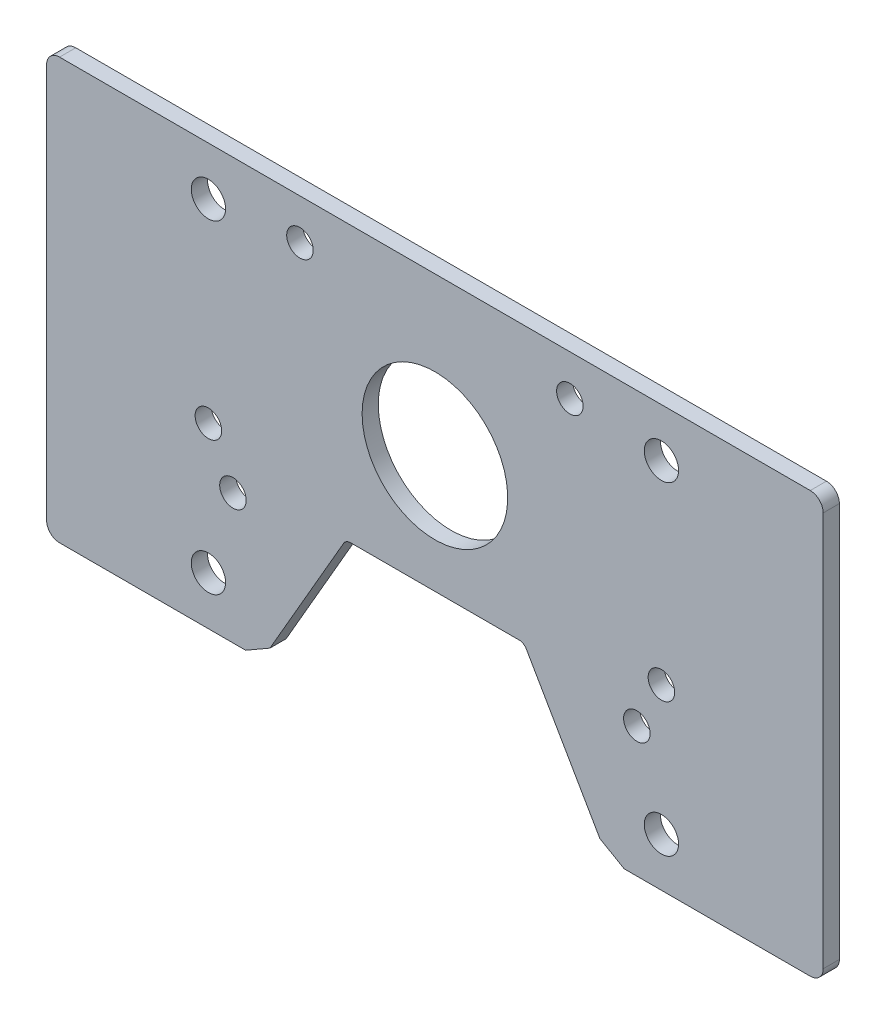
ISO-10303-21;
HEADER;
FILE_DESCRIPTION(('STEP AP214'),'2;1');
FILE_NAME('part.step','',(''),(''),'','','');
FILE_SCHEMA(('AUTOMOTIVE_DESIGN { 1 0 10303 214 1 1 1 1 }'));
ENDSEC;
DATA;
#1=APPLICATION_CONTEXT('core data for automotive mechanical design processes');
#2=APPLICATION_PROTOCOL_DEFINITION('international standard','automotive_design',2000,#1);
#3=PRODUCT_CONTEXT('',#1,'mechanical');
#4=PRODUCT('Part','Part','',(#3));
#5=PRODUCT_RELATED_PRODUCT_CATEGORY('part','',(#4));
#6=PRODUCT_DEFINITION_FORMATION('','',#4);
#7=PRODUCT_DEFINITION_CONTEXT('part definition',#1,'design');
#8=PRODUCT_DEFINITION('design','',#6,#7);
#9=PRODUCT_DEFINITION_SHAPE('','',#8);
#10=(LENGTH_UNIT() NAMED_UNIT(*) SI_UNIT(.MILLI.,.METRE.));
#11=(NAMED_UNIT(*) PLANE_ANGLE_UNIT() SI_UNIT($,.RADIAN.));
#12=(NAMED_UNIT(*) SI_UNIT($,.STERADIAN.) SOLID_ANGLE_UNIT());
#13=UNCERTAINTY_MEASURE_WITH_UNIT(LENGTH_MEASURE(1.E-05),#10,'distance_accuracy_value','');
#14=(GEOMETRIC_REPRESENTATION_CONTEXT(3) GLOBAL_UNCERTAINTY_ASSIGNED_CONTEXT((#13)) GLOBAL_UNIT_ASSIGNED_CONTEXT((#10,
#11,#12)) REPRESENTATION_CONTEXT('',''));
#15=CARTESIAN_POINT('',(0.,0.,0.));
#16=DIRECTION('',(0.,0.,1.));
#17=DIRECTION('',(1.,0.,0.));
#18=AXIS2_PLACEMENT_3D('',#15,#16,#17);
#19=CARTESIAN_POINT('',(37.1352839420935,-28.575,0.));
#20=DIRECTION('',(0.,-1.,0.));
#21=DIRECTION('',(1.,0.,0.));
#22=AXIS2_PLACEMENT_3D('',#19,#20,#21);
#23=PLANE('',#22);
#24=DIRECTION('',(1.,0.,0.));
#25=VECTOR('',#24,1.);
#26=CARTESIAN_POINT('',(37.1352839420935,-28.575,0.));
#27=LINE('',#26,#25);
#28=CARTESIAN_POINT('',(37.1352839420935,-28.575,0.));
#29=VERTEX_POINT('',#28);
#30=CARTESIAN_POINT('',(73.66,-28.575,0.));
#31=VERTEX_POINT('',#30);
#32=EDGE_CURVE('E163',#29,#31,#27,.T.);
#33=ORIENTED_EDGE('',*,*,#32,.T.);
#34=DIRECTION('',(0.,0.,1.));
#35=VECTOR('',#34,1.);
#36=CARTESIAN_POINT('',(73.66,-28.575,0.));
#37=LINE('',#36,#35);
#38=CARTESIAN_POINT('',(73.66,-28.575,3.175));
#39=VERTEX_POINT('',#38);
#40=EDGE_CURVE('E259',#31,#39,#37,.T.);
#41=ORIENTED_EDGE('',*,*,#40,.T.);
#42=DIRECTION('',(1.,0.,0.));
#43=VECTOR('',#42,1.);
#44=CARTESIAN_POINT('',(37.1352839420935,-28.575,3.175));
#45=LINE('',#44,#43);
#46=CARTESIAN_POINT('',(37.1352839420935,-28.575,3.175));
#47=VERTEX_POINT('',#46);
#48=EDGE_CURVE('E218',#47,#39,#45,.T.);
#49=ORIENTED_EDGE('',*,*,#48,.F.);
#50=DIRECTION('',(0.,0.,1.));
#51=VECTOR('',#50,1.);
#52=CARTESIAN_POINT('',(37.1352839420935,-28.575,0.));
#53=LINE('',#52,#51);
#54=EDGE_CURVE('E221',#29,#47,#53,.T.);
#55=ORIENTED_EDGE('',*,*,#54,.F.);
#56=EDGE_LOOP('',(#33,#41,#49,#55));
#57=FACE_BOUND('',#56,.T.);
#58=ADVANCED_FACE('F33',(#57),#23,.T.);
#59=CARTESIAN_POINT('',(32.3727839420935,-25.8253693429844,0.));
#60=DIRECTION('',(-0.499999999999999,-0.866025403784439,0.));
#61=DIRECTION('',(0.866025403784439,-0.499999999999999,0.));
#62=AXIS2_PLACEMENT_3D('',#59,#60,#61);
#63=PLANE('',#62);
#64=DIRECTION('',(0.866025403784439,-0.499999999999999,0.));
#65=VECTOR('',#64,1.);
#66=CARTESIAN_POINT('',(32.3727839420935,-25.8253693429844,3.175));
#67=LINE('',#66,#65);
#68=CARTESIAN_POINT('',(32.3727839420935,-25.8253693429844,3.175));
#69=VERTEX_POINT('',#68);
#70=EDGE_CURVE('E215',#69,#47,#67,.T.);
#71=ORIENTED_EDGE('',*,*,#70,.F.);
#72=DIRECTION('',(0.,0.,1.));
#73=VECTOR('',#72,1.);
#74=CARTESIAN_POINT('',(32.3727839420935,-25.8253693429844,0.));
#75=LINE('',#74,#73);
#76=CARTESIAN_POINT('',(32.3727839420935,-25.8253693429844,0.));
#77=VERTEX_POINT('',#76);
#78=EDGE_CURVE('E224',#77,#69,#75,.T.);
#79=ORIENTED_EDGE('',*,*,#78,.F.);
#80=DIRECTION('',(0.866025403784439,-0.499999999999999,0.));
#81=VECTOR('',#80,1.);
#82=CARTESIAN_POINT('',(32.3727839420935,-25.8253693429844,0.));
#83=LINE('',#82,#81);
#84=EDGE_CURVE('E188',#77,#29,#83,.T.);
#85=ORIENTED_EDGE('',*,*,#84,.T.);
#86=ORIENTED_EDGE('',*,*,#54,.T.);
#87=EDGE_LOOP('',(#71,#79,#85,#86));
#88=FACE_BOUND('',#87,.T.);
#89=ADVANCED_FACE('F361',(#88),#63,.T.);
#90=CARTESIAN_POINT('',(17.9207717761693,-0.793749999999998,0.));
#91=DIRECTION('',(-0.86602540378444,-0.499999999999998,0.));
#92=DIRECTION('',(0.499999999999998,-0.86602540378444,0.));
#93=AXIS2_PLACEMENT_3D('',#90,#91,#92);
#94=PLANE('',#93);
#95=DIRECTION('',(0.499999999999998,-0.86602540378444,0.));
#96=VECTOR('',#95,1.);
#97=CARTESIAN_POINT('',(17.9207717761693,-0.793749999999998,3.175));
#98=LINE('',#97,#96);
#99=CARTESIAN_POINT('',(17.9207717761693,-0.793749999999998,3.175));
#100=VERTEX_POINT('',#99);
#101=EDGE_CURVE('E212',#100,#69,#98,.T.);
#102=ORIENTED_EDGE('',*,*,#101,.F.);
#103=DIRECTION('',(0.,0.,1.));
#104=VECTOR('',#103,1.);
#105=CARTESIAN_POINT('',(17.9207717761693,-0.793749999999998,0.));
#106=LINE('',#105,#104);
#107=CARTESIAN_POINT('',(17.9207717761693,-0.793749999999998,0.));
#108=VERTEX_POINT('',#107);
#109=EDGE_CURVE('E226',#108,#100,#106,.T.);
#110=ORIENTED_EDGE('',*,*,#109,.F.);
#111=DIRECTION('',(0.499999999999998,-0.86602540378444,0.));
#112=VECTOR('',#111,1.);
#113=CARTESIAN_POINT('',(17.9207717761693,-0.793749999999998,0.));
#114=LINE('',#113,#112);
#115=EDGE_CURVE('E185',#108,#77,#114,.T.);
#116=ORIENTED_EDGE('',*,*,#115,.T.);
#117=ORIENTED_EDGE('',*,*,#78,.T.);
#118=EDGE_LOOP('',(#102,#110,#116,#117));
#119=FACE_BOUND('',#118,.T.);
#120=ADVANCED_FACE('F367',(#119),#94,.T.);
#121=CARTESIAN_POINT('',(16.5459564476615,-1.5875,0.));
#122=DIRECTION('',(0.,0.,1.));
#123=DIRECTION('',(1.,0.,0.));
#124=AXIS2_PLACEMENT_3D('',#121,#122,#123);
#125=CYLINDRICAL_SURFACE('',#124,1.5875);
#126=CARTESIAN_POINT('',(16.5459564476615,-1.5875,3.175));
#127=DIRECTION('',(0.,0.,-1.));
#128=DIRECTION('',(-1.,0.,0.));
#129=AXIS2_PLACEMENT_3D('',#126,#127,#128);
#130=CIRCLE('',#129,1.5875);
#131=CARTESIAN_POINT('',(16.5459564476615,0.,3.175));
#132=VERTEX_POINT('',#131);
#133=EDGE_CURVE('E209',#132,#100,#130,.T.);
#134=ORIENTED_EDGE('',*,*,#133,.F.);
#135=DIRECTION('',(0.,0.,1.));
#136=VECTOR('',#135,1.);
#137=CARTESIAN_POINT('',(16.5459564476615,0.,0.));
#138=LINE('',#137,#136);
#139=CARTESIAN_POINT('',(16.5459564476615,0.,0.));
#140=VERTEX_POINT('',#139);
#141=EDGE_CURVE('E228',#140,#132,#138,.T.);
#142=ORIENTED_EDGE('',*,*,#141,.F.);
#143=CARTESIAN_POINT('',(16.5459564476615,-1.5875,0.));
#144=DIRECTION('',(0.,0.,-1.));
#145=DIRECTION('',(-1.,0.,0.));
#146=AXIS2_PLACEMENT_3D('',#143,#144,#145);
#147=CIRCLE('',#146,1.5875);
#148=EDGE_CURVE('E182',#140,#108,#147,.T.);
#149=ORIENTED_EDGE('',*,*,#148,.T.);
#150=ORIENTED_EDGE('',*,*,#109,.T.);
#151=EDGE_LOOP('',(#134,#142,#149,#150));
#152=FACE_BOUND('',#151,.T.);
#153=ADVANCED_FACE('F375',(#152),#125,.F.);
#154=CARTESIAN_POINT('',(-16.5459564476615,0.,0.));
#155=DIRECTION('',(0.,-1.,0.));
#156=DIRECTION('',(1.,0.,0.));
#157=AXIS2_PLACEMENT_3D('',#154,#155,#156);
#158=PLANE('',#157);
#159=DIRECTION('',(1.,0.,0.));
#160=VECTOR('',#159,1.);
#161=CARTESIAN_POINT('',(-16.5459564476615,0.,3.175));
#162=LINE('',#161,#160);
#163=CARTESIAN_POINT('',(-16.5459564476615,0.,3.175));
#164=VERTEX_POINT('',#163);
#165=EDGE_CURVE('E206',#164,#132,#162,.T.);
#166=ORIENTED_EDGE('',*,*,#165,.F.);
#167=DIRECTION('',(0.,0.,1.));
#168=VECTOR('',#167,1.);
#169=CARTESIAN_POINT('',(-16.5459564476615,0.,0.));
#170=LINE('',#169,#168);
#171=CARTESIAN_POINT('',(-16.5459564476615,0.,0.));
#172=VERTEX_POINT('',#171);
#173=EDGE_CURVE('E230',#172,#164,#170,.T.);
#174=ORIENTED_EDGE('',*,*,#173,.F.);
#175=DIRECTION('',(1.,0.,0.));
#176=VECTOR('',#175,1.);
#177=CARTESIAN_POINT('',(-16.5459564476615,0.,0.));
#178=LINE('',#177,#176);
#179=EDGE_CURVE('E179',#172,#140,#178,.T.);
#180=ORIENTED_EDGE('',*,*,#179,.T.);
#181=ORIENTED_EDGE('',*,*,#141,.T.);
#182=EDGE_LOOP('',(#166,#174,#180,#181));
#183=FACE_BOUND('',#182,.T.);
#184=ADVANCED_FACE('F379',(#183),#158,.T.);
#185=CARTESIAN_POINT('',(-16.5459564476615,-1.5875,0.));
#186=DIRECTION('',(0.,0.,1.));
#187=DIRECTION('',(1.,0.,0.));
#188=AXIS2_PLACEMENT_3D('',#185,#186,#187);
#189=CYLINDRICAL_SURFACE('',#188,1.5875);
#190=CARTESIAN_POINT('',(-16.5459564476615,-1.5875,3.175));
#191=DIRECTION('',(0.,0.,-1.));
#192=DIRECTION('',(-1.,0.,0.));
#193=AXIS2_PLACEMENT_3D('',#190,#191,#192);
#194=CIRCLE('',#193,1.5875);
#195=CARTESIAN_POINT('',(-17.9207717761693,-0.793750000000005,3.175));
#196=VERTEX_POINT('',#195);
#197=EDGE_CURVE('E203',#196,#164,#194,.T.);
#198=ORIENTED_EDGE('',*,*,#197,.F.);
#199=DIRECTION('',(0.,0.,1.));
#200=VECTOR('',#199,1.);
#201=CARTESIAN_POINT('',(-17.9207717761693,-0.793750000000005,0.));
#202=LINE('',#201,#200);
#203=CARTESIAN_POINT('',(-17.9207717761693,-0.793750000000005,0.));
#204=VERTEX_POINT('',#203);
#205=EDGE_CURVE('E232',#204,#196,#202,.T.);
#206=ORIENTED_EDGE('',*,*,#205,.F.);
#207=CARTESIAN_POINT('',(-16.5459564476615,-1.5875,0.));
#208=DIRECTION('',(0.,0.,-1.));
#209=DIRECTION('',(-1.,0.,0.));
#210=AXIS2_PLACEMENT_3D('',#207,#208,#209);
#211=CIRCLE('',#210,1.5875);
#212=EDGE_CURVE('E173',#204,#172,#211,.T.);
#213=ORIENTED_EDGE('',*,*,#212,.T.);
#214=ORIENTED_EDGE('',*,*,#173,.T.);
#215=EDGE_LOOP('',(#198,#206,#213,#214));
#216=FACE_BOUND('',#215,.T.);
#217=ADVANCED_FACE('F383',(#216),#189,.F.);
#218=CARTESIAN_POINT('',(-32.3727839420934,-25.8253693429844,0.));
#219=DIRECTION('',(0.86602540378444,-0.499999999999997,0.));
#220=DIRECTION('',(0.499999999999998,0.86602540378444,0.));
#221=AXIS2_PLACEMENT_3D('',#218,#219,#220);
#222=PLANE('',#221);
#223=DIRECTION('',(0.499999999999998,0.86602540378444,0.));
#224=VECTOR('',#223,1.);
#225=CARTESIAN_POINT('',(-32.3727839420934,-25.8253693429844,3.175));
#226=LINE('',#225,#224);
#227=CARTESIAN_POINT('',(-32.3727839420934,-25.8253693429844,3.175));
#228=VERTEX_POINT('',#227);
#229=EDGE_CURVE('E200',#228,#196,#226,.T.);
#230=ORIENTED_EDGE('',*,*,#229,.F.);
#231=DIRECTION('',(0.,0.,1.));
#232=VECTOR('',#231,1.);
#233=CARTESIAN_POINT('',(-32.3727839420934,-25.8253693429844,0.));
#234=LINE('',#233,#232);
#235=CARTESIAN_POINT('',(-32.3727839420934,-25.8253693429844,0.));
#236=VERTEX_POINT('',#235);
#237=EDGE_CURVE('E162',#236,#228,#234,.T.);
#238=ORIENTED_EDGE('',*,*,#237,.F.);
#239=DIRECTION('',(0.499999999999998,0.86602540378444,0.));
#240=VECTOR('',#239,1.);
#241=CARTESIAN_POINT('',(-32.3727839420934,-25.8253693429844,0.));
#242=LINE('',#241,#240);
#243=EDGE_CURVE('E171',#236,#204,#242,.T.);
#244=ORIENTED_EDGE('',*,*,#243,.T.);
#245=ORIENTED_EDGE('',*,*,#205,.T.);
#246=EDGE_LOOP('',(#230,#238,#244,#245));
#247=FACE_BOUND('',#246,.T.);
#248=ADVANCED_FACE('F387',(#247),#222,.T.);
#249=CARTESIAN_POINT('',(-37.1352839420935,-28.575,0.));
#250=DIRECTION('',(0.500000000000002,-0.866025403784438,0.));
#251=DIRECTION('',(0.866025403784438,0.500000000000002,0.));
#252=AXIS2_PLACEMENT_3D('',#249,#250,#251);
#253=PLANE('',#252);
#254=DIRECTION('',(0.866025403784438,0.500000000000002,0.));
#255=VECTOR('',#254,1.);
#256=CARTESIAN_POINT('',(-37.1352839420935,-28.575,3.175));
#257=LINE('',#256,#255);
#258=CARTESIAN_POINT('',(-37.1352839420935,-28.575,3.175));
#259=VERTEX_POINT('',#258);
#260=EDGE_CURVE('E161',#259,#228,#257,.T.);
#261=ORIENTED_EDGE('',*,*,#260,.F.);
#262=DIRECTION('',(0.,0.,1.));
#263=VECTOR('',#262,1.);
#264=CARTESIAN_POINT('',(-37.1352839420935,-28.575,0.));
#265=LINE('',#264,#263);
#266=CARTESIAN_POINT('',(-37.1352839420935,-28.575,0.));
#267=VERTEX_POINT('',#266);
#268=EDGE_CURVE('E150',#267,#259,#265,.T.);
#269=ORIENTED_EDGE('',*,*,#268,.F.);
#270=DIRECTION('',(0.866025403784438,0.500000000000002,0.));
#271=VECTOR('',#270,1.);
#272=CARTESIAN_POINT('',(-37.1352839420935,-28.575,0.));
#273=LINE('',#272,#271);
#274=EDGE_CURVE('E154',#267,#236,#273,.T.);
#275=ORIENTED_EDGE('',*,*,#274,.T.);
#276=ORIENTED_EDGE('',*,*,#237,.T.);
#277=EDGE_LOOP('',(#261,#269,#275,#276));
#278=FACE_BOUND('',#277,.T.);
#279=ADVANCED_FACE('F159',(#278),#253,.T.);
#280=CARTESIAN_POINT('',(-50.8,-28.575,0.));
#281=DIRECTION('',(0.,-1.,0.));
#282=DIRECTION('',(0.,0.,-1.));
#283=AXIS2_PLACEMENT_3D('',#280,#281,#282);
#284=PLANE('',#283);
#285=DIRECTION('',(1.,0.,0.));
#286=VECTOR('',#285,1.);
#287=CARTESIAN_POINT('',(-50.8,-28.575,3.175));
#288=LINE('',#287,#286);
#289=CARTESIAN_POINT('',(-73.66,-28.575,3.175));
#290=VERTEX_POINT('',#289);
#291=EDGE_CURVE('E196',#290,#259,#288,.T.);
#292=ORIENTED_EDGE('',*,*,#291,.F.);
#293=DIRECTION('',(0.,0.,1.));
#294=VECTOR('',#293,1.);
#295=CARTESIAN_POINT('',(-73.66,-28.575,0.));
#296=LINE('',#295,#294);
#297=CARTESIAN_POINT('',(-73.66,-28.575,0.));
#298=VERTEX_POINT('',#297);
#299=EDGE_CURVE('E11',#290,#298,#296,.F.);
#300=ORIENTED_EDGE('',*,*,#299,.T.);
#301=DIRECTION('',(1.,0.,0.));
#302=VECTOR('',#301,1.);
#303=CARTESIAN_POINT('',(-50.8,-28.575,0.));
#304=LINE('',#303,#302);
#305=EDGE_CURVE('E146',#298,#267,#304,.T.);
#306=ORIENTED_EDGE('',*,*,#305,.T.);
#307=ORIENTED_EDGE('',*,*,#268,.T.);
#308=EDGE_LOOP('',(#292,#300,#306,#307));
#309=FACE_BOUND('',#308,.T.);
#310=ADVANCED_FACE('F149',(#309),#284,.T.);
#311=CARTESIAN_POINT('',(50.8,53.975,0.));
#312=DIRECTION('',(0.,1.,0.));
#313=DIRECTION('',(0.,0.,1.));
#314=AXIS2_PLACEMENT_3D('',#311,#312,#313);
#315=PLANE('',#314);
#316=DIRECTION('',(-1.,0.,0.));
#317=VECTOR('',#316,1.);
#318=CARTESIAN_POINT('',(50.8,53.975,3.175));
#319=LINE('',#318,#317);
#320=CARTESIAN_POINT('',(73.66,53.975,3.175));
#321=VERTEX_POINT('',#320);
#322=CARTESIAN_POINT('',(-73.66,53.975,3.175));
#323=VERTEX_POINT('',#322);
#324=EDGE_CURVE('E193',#321,#323,#319,.T.);
#325=ORIENTED_EDGE('',*,*,#324,.F.);
#326=DIRECTION('',(0.,0.,1.));
#327=VECTOR('',#326,1.);
#328=CARTESIAN_POINT('',(73.66,53.975,0.));
#329=LINE('',#328,#327);
#330=CARTESIAN_POINT('',(73.66,53.975,0.));
#331=VERTEX_POINT('',#330);
#332=EDGE_CURVE('E250',#321,#331,#329,.F.);
#333=ORIENTED_EDGE('',*,*,#332,.T.);
#334=DIRECTION('',(-1.,0.,0.));
#335=VECTOR('',#334,1.);
#336=CARTESIAN_POINT('',(50.8,53.975,0.));
#337=LINE('',#336,#335);
#338=CARTESIAN_POINT('',(-73.66,53.975,0.));
#339=VERTEX_POINT('',#338);
#340=EDGE_CURVE('E155',#331,#339,#337,.T.);
#341=ORIENTED_EDGE('',*,*,#340,.T.);
#342=DIRECTION('',(0.,0.,1.));
#343=VECTOR('',#342,1.);
#344=CARTESIAN_POINT('',(-73.66,53.975,0.));
#345=LINE('',#344,#343);
#346=EDGE_CURVE('E247',#339,#323,#345,.T.);
#347=ORIENTED_EDGE('',*,*,#346,.T.);
#348=EDGE_LOOP('',(#325,#333,#341,#347));
#349=FACE_BOUND('',#348,.T.);
#350=ADVANCED_FACE('F349',(#349),#315,.T.);
#351=CARTESIAN_POINT('',(-16.5459564476615,-1.5875,0.));
#352=DIRECTION('',(0.,0.,-1.));
#353=DIRECTION('',(-1.,0.,0.));
#354=AXIS2_PLACEMENT_3D('',#351,#352,#353);
#355=PLANE('',#354);
#356=ORIENTED_EDGE('',*,*,#340,.F.);
#357=CARTESIAN_POINT('',(73.66,51.435,0.));
#358=DIRECTION('',(0.,0.,-1.));
#359=DIRECTION('',(-1.,0.,0.));
#360=AXIS2_PLACEMENT_3D('',#357,#358,#359);
#361=CIRCLE('',#360,2.54);
#362=CARTESIAN_POINT('',(76.2,51.435,0.));
#363=VERTEX_POINT('',#362);
#364=EDGE_CURVE('E257',#331,#363,#361,.T.);
#365=ORIENTED_EDGE('',*,*,#364,.T.);
#366=DIRECTION('',(0.,1.,0.));
#367=VECTOR('',#366,1.);
#368=CARTESIAN_POINT('',(76.2,53.975,0.));
#369=LINE('',#368,#367);
#370=CARTESIAN_POINT('',(76.2,-26.035,0.));
#371=VERTEX_POINT('',#370);
#372=EDGE_CURVE('E273',#371,#363,#369,.T.);
#373=ORIENTED_EDGE('',*,*,#372,.F.);
#374=CARTESIAN_POINT('',(73.66,-26.035,0.));
#375=DIRECTION('',(0.,0.,-1.));
#376=DIRECTION('',(-1.,0.,0.));
#377=AXIS2_PLACEMENT_3D('',#374,#375,#376);
#378=CIRCLE('',#377,2.54);
#379=EDGE_CURVE('E255',#371,#31,#378,.T.);
#380=ORIENTED_EDGE('',*,*,#379,.T.);
#381=ORIENTED_EDGE('',*,*,#32,.F.);
#382=ORIENTED_EDGE('',*,*,#84,.F.);
#383=ORIENTED_EDGE('',*,*,#115,.F.);
#384=ORIENTED_EDGE('',*,*,#148,.F.);
#385=ORIENTED_EDGE('',*,*,#179,.F.);
#386=ORIENTED_EDGE('',*,*,#212,.F.);
#387=ORIENTED_EDGE('',*,*,#243,.F.);
#388=ORIENTED_EDGE('',*,*,#274,.F.);
#389=ORIENTED_EDGE('',*,*,#305,.F.);
#390=CARTESIAN_POINT('',(-73.66,-26.035,0.));
#391=DIRECTION('',(0.,0.,-1.));
#392=DIRECTION('',(-1.,0.,0.));
#393=AXIS2_PLACEMENT_3D('',#390,#391,#392);
#394=CIRCLE('',#393,2.54);
#395=CARTESIAN_POINT('',(-76.2,-26.035,0.));
#396=VERTEX_POINT('',#395);
#397=EDGE_CURVE('E48',#298,#396,#394,.T.);
#398=ORIENTED_EDGE('',*,*,#397,.T.);
#399=DIRECTION('',(0.,-1.,0.));
#400=VECTOR('',#399,1.);
#401=CARTESIAN_POINT('',(-76.2,53.975,0.));
#402=LINE('',#401,#400);
#403=CARTESIAN_POINT('',(-76.2,51.435,0.));
#404=VERTEX_POINT('',#403);
#405=EDGE_CURVE('E267',#404,#396,#402,.T.);
#406=ORIENTED_EDGE('',*,*,#405,.F.);
#407=CARTESIAN_POINT('',(-73.66,51.435,0.));
#408=DIRECTION('',(0.,0.,-1.));
#409=DIRECTION('',(-1.,0.,0.));
#410=AXIS2_PLACEMENT_3D('',#407,#408,#409);
#411=CIRCLE('',#410,2.54);
#412=EDGE_CURVE('E252',#404,#339,#411,.T.);
#413=ORIENTED_EDGE('',*,*,#412,.T.);
#414=EDGE_LOOP('',(#356,#365,#373,#380,#381,#382,#383,#384,#385,#386,#387,#388,#389,#398,#406,#413));
#415=FACE_BOUND('',#414,.T.);
#416=CARTESIAN_POINT('',(39.632108696,-3.06328216400001,0.));
#417=DIRECTION('',(0.,0.,1.));
#418=DIRECTION('',(-1.,0.,0.));
#419=AXIS2_PLACEMENT_3D('',#416,#417,#418);
#420=CIRCLE('',#419,2.6035);
#421=CARTESIAN_POINT('',(37.028608696,-3.06328216400001,0.));
#422=VERTEX_POINT('',#421);
#423=EDGE_CURVE('E282',#422,#422,#420,.T.);
#424=ORIENTED_EDGE('',*,*,#423,.T.);
#425=EDGE_LOOP('',(#424));
#426=FACE_BOUND('',#425,.T.);
#427=CARTESIAN_POINT('',(-26.4841012047918,46.0057498114846,0.));
#428=DIRECTION('',(0.,0.,1.));
#429=DIRECTION('',(-1.,0.,0.));
#430=AXIS2_PLACEMENT_3D('',#427,#428,#429);
#431=CIRCLE('',#430,2.6035);
#432=CARTESIAN_POINT('',(-29.0876012047918,46.0057498114846,0.));
#433=VERTEX_POINT('',#432);
#434=EDGE_CURVE('E288',#433,#433,#431,.T.);
#435=ORIENTED_EDGE('',*,*,#434,.T.);
#436=EDGE_LOOP('',(#435));
#437=FACE_BOUND('',#436,.T.);
#438=CARTESIAN_POINT('',(-44.45,6.34999999999999,0.));
#439=DIRECTION('',(0.,0.,1.));
#440=DIRECTION('',(-1.,0.,0.));
#441=AXIS2_PLACEMENT_3D('',#438,#439,#440);
#442=CIRCLE('',#441,2.6035);
#443=CARTESIAN_POINT('',(-47.0535,6.34999999999999,0.));
#444=VERTEX_POINT('',#443);
#445=EDGE_CURVE('E294',#444,#444,#442,.T.);
#446=ORIENTED_EDGE('',*,*,#445,.T.);
#447=EDGE_LOOP('',(#446));
#448=FACE_BOUND('',#447,.T.);
#449=CARTESIAN_POINT('',(-44.45,-19.05,0.));
#450=DIRECTION('',(0.,0.,1.));
#451=DIRECTION('',(-1.,0.,0.));
#452=AXIS2_PLACEMENT_3D('',#449,#450,#451);
#453=CIRCLE('',#452,3.3655);
#454=CARTESIAN_POINT('',(-47.8155,-19.05,0.));
#455=VERTEX_POINT('',#454);
#456=EDGE_CURVE('E300',#455,#455,#453,.T.);
#457=ORIENTED_EDGE('',*,*,#456,.T.);
#458=EDGE_LOOP('',(#457));
#459=FACE_BOUND('',#458,.T.);
#460=CARTESIAN_POINT('',(-44.45,44.45,0.));
#461=DIRECTION('',(0.,0.,1.));
#462=DIRECTION('',(-1.,0.,0.));
#463=AXIS2_PLACEMENT_3D('',#460,#461,#462);
#464=CIRCLE('',#463,3.3655);
#465=CARTESIAN_POINT('',(-47.8155,44.45,0.));
#466=VERTEX_POINT('',#465);
#467=EDGE_CURVE('E306',#466,#466,#464,.T.);
#468=ORIENTED_EDGE('',*,*,#467,.T.);
#469=EDGE_LOOP('',(#468));
#470=FACE_BOUND('',#469,.T.);
#471=CARTESIAN_POINT('',(0.,23.058733918,0.));
#472=DIRECTION('',(0.,0.,1.));
#473=DIRECTION('',(-1.,0.,0.));
#474=AXIS2_PLACEMENT_3D('',#471,#472,#473);
#475=CIRCLE('',#474,14.2875);
#476=CARTESIAN_POINT('',(-14.2875,23.058733918,0.));
#477=VERTEX_POINT('',#476);
#478=EDGE_CURVE('E312',#477,#477,#475,.T.);
#479=ORIENTED_EDGE('',*,*,#478,.T.);
#480=EDGE_LOOP('',(#479));
#481=FACE_BOUND('',#480,.T.);
#482=CARTESIAN_POINT('',(44.45,44.45,0.));
#483=DIRECTION('',(0.,0.,1.));
#484=DIRECTION('',(-1.,0.,0.));
#485=AXIS2_PLACEMENT_3D('',#482,#483,#484);
#486=CIRCLE('',#485,3.3655);
#487=CARTESIAN_POINT('',(41.0845,44.45,0.));
#488=VERTEX_POINT('',#487);
#489=EDGE_CURVE('E318',#488,#488,#486,.T.);
#490=ORIENTED_EDGE('',*,*,#489,.T.);
#491=EDGE_LOOP('',(#490));
#492=FACE_BOUND('',#491,.T.);
#493=CARTESIAN_POINT('',(44.45,-19.05,0.));
#494=DIRECTION('',(0.,0.,1.));
#495=DIRECTION('',(-1.,0.,0.));
#496=AXIS2_PLACEMENT_3D('',#493,#494,#495);
#497=CIRCLE('',#496,3.3655);
#498=CARTESIAN_POINT('',(41.0845,-19.05,0.));
#499=VERTEX_POINT('',#498);
#500=EDGE_CURVE('E324',#499,#499,#497,.T.);
#501=ORIENTED_EDGE('',*,*,#500,.T.);
#502=EDGE_LOOP('',(#501));
#503=FACE_BOUND('',#502,.T.);
#504=CARTESIAN_POINT('',(-39.632108696,-3.06328216400001,0.));
#505=DIRECTION('',(0.,0.,1.));
#506=DIRECTION('',(-1.,0.,0.));
#507=AXIS2_PLACEMENT_3D('',#504,#505,#506);
#508=CIRCLE('',#507,2.6035);
#509=CARTESIAN_POINT('',(-42.235608696,-3.06328216400001,0.));
#510=VERTEX_POINT('',#509);
#511=EDGE_CURVE('E330',#510,#510,#508,.T.);
#512=ORIENTED_EDGE('',*,*,#511,.T.);
#513=EDGE_LOOP('',(#512));
#514=FACE_BOUND('',#513,.T.);
#515=CARTESIAN_POINT('',(26.4841012047918,46.0057498114846,0.));
#516=DIRECTION('',(0.,0.,1.));
#517=DIRECTION('',(-1.,0.,0.));
#518=AXIS2_PLACEMENT_3D('',#515,#516,#517);
#519=CIRCLE('',#518,2.6035);
#520=CARTESIAN_POINT('',(23.8806012047918,46.0057498114846,0.));
#521=VERTEX_POINT('',#520);
#522=EDGE_CURVE('E336',#521,#521,#519,.T.);
#523=ORIENTED_EDGE('',*,*,#522,.T.);
#524=EDGE_LOOP('',(#523));
#525=FACE_BOUND('',#524,.T.);
#526=CARTESIAN_POINT('',(44.45,6.35000000000001,0.));
#527=DIRECTION('',(0.,0.,1.));
#528=DIRECTION('',(-1.,0.,0.));
#529=AXIS2_PLACEMENT_3D('',#526,#527,#528);
#530=CIRCLE('',#529,2.6035);
#531=CARTESIAN_POINT('',(41.8465,6.35000000000001,0.));
#532=VERTEX_POINT('',#531);
#533=EDGE_CURVE('E197',#532,#532,#530,.T.);
#534=ORIENTED_EDGE('',*,*,#533,.T.);
#535=EDGE_LOOP('',(#534));
#536=FACE_BOUND('',#535,.T.);
#537=ADVANCED_FACE('F167',(#415,#426,#437,#448,#459,#470,#481,#492,#503,#514,#525,#536),#355,.T.);
#538=CARTESIAN_POINT('',(-16.5459564476615,-1.5875,3.175));
#539=DIRECTION('',(0.,0.,-1.));
#540=DIRECTION('',(-1.,0.,0.));
#541=AXIS2_PLACEMENT_3D('',#538,#539,#540);
#542=PLANE('',#541);
#543=DIRECTION('',(0.,1.,0.));
#544=VECTOR('',#543,1.);
#545=CARTESIAN_POINT('',(76.2,53.975,3.175));
#546=LINE('',#545,#544);
#547=CARTESIAN_POINT('',(76.2,-26.035,3.175));
#548=VERTEX_POINT('',#547);
#549=CARTESIAN_POINT('',(76.2,51.435,3.175));
#550=VERTEX_POINT('',#549);
#551=EDGE_CURVE('E278',#548,#550,#546,.T.);
#552=ORIENTED_EDGE('',*,*,#551,.T.);
#553=CARTESIAN_POINT('',(73.66,51.435,3.175));
#554=DIRECTION('',(0.,0.,-1.));
#555=DIRECTION('',(-1.,0.,0.));
#556=AXIS2_PLACEMENT_3D('',#553,#554,#555);
#557=CIRCLE('',#556,2.54);
#558=EDGE_CURVE('E245',#550,#321,#557,.F.);
#559=ORIENTED_EDGE('',*,*,#558,.T.);
#560=ORIENTED_EDGE('',*,*,#324,.T.);
#561=CARTESIAN_POINT('',(-73.66,51.435,3.175));
#562=DIRECTION('',(0.,0.,-1.));
#563=DIRECTION('',(-1.,0.,0.));
#564=AXIS2_PLACEMENT_3D('',#561,#562,#563);
#565=CIRCLE('',#564,2.54);
#566=CARTESIAN_POINT('',(-76.2,51.435,3.175));
#567=VERTEX_POINT('',#566);
#568=EDGE_CURVE('E239',#323,#567,#565,.F.);
#569=ORIENTED_EDGE('',*,*,#568,.T.);
#570=DIRECTION('',(0.,-1.,0.));
#571=VECTOR('',#570,1.);
#572=CARTESIAN_POINT('',(-76.2,53.975,3.175));
#573=LINE('',#572,#571);
#574=CARTESIAN_POINT('',(-76.2,-26.035,3.175));
#575=VERTEX_POINT('',#574);
#576=EDGE_CURVE('E266',#567,#575,#573,.T.);
#577=ORIENTED_EDGE('',*,*,#576,.T.);
#578=CARTESIAN_POINT('',(-73.66,-26.035,3.175));
#579=DIRECTION('',(0.,0.,-1.));
#580=DIRECTION('',(-1.,0.,0.));
#581=AXIS2_PLACEMENT_3D('',#578,#579,#580);
#582=CIRCLE('',#581,2.54);
#583=EDGE_CURVE('E241',#575,#290,#582,.F.);
#584=ORIENTED_EDGE('',*,*,#583,.T.);
#585=ORIENTED_EDGE('',*,*,#291,.T.);
#586=ORIENTED_EDGE('',*,*,#260,.T.);
#587=ORIENTED_EDGE('',*,*,#229,.T.);
#588=ORIENTED_EDGE('',*,*,#197,.T.);
#589=ORIENTED_EDGE('',*,*,#165,.T.);
#590=ORIENTED_EDGE('',*,*,#133,.T.);
#591=ORIENTED_EDGE('',*,*,#101,.T.);
#592=ORIENTED_EDGE('',*,*,#70,.T.);
#593=ORIENTED_EDGE('',*,*,#48,.T.);
#594=CARTESIAN_POINT('',(73.66,-26.035,3.175));
#595=DIRECTION('',(0.,0.,-1.));
#596=DIRECTION('',(-1.,0.,0.));
#597=AXIS2_PLACEMENT_3D('',#594,#595,#596);
#598=CIRCLE('',#597,2.54);
#599=EDGE_CURVE('E243',#39,#548,#598,.F.);
#600=ORIENTED_EDGE('',*,*,#599,.T.);
#601=EDGE_LOOP('',(#552,#559,#560,#569,#577,#584,#585,#586,#587,#588,#589,#590,#591,#592,#593,#600));
#602=FACE_BOUND('',#601,.T.);
#603=CARTESIAN_POINT('',(39.632108696,-3.06328216400001,3.175));
#604=DIRECTION('',(0.,0.,1.));
#605=DIRECTION('',(-1.,0.,0.));
#606=AXIS2_PLACEMENT_3D('',#603,#604,#605);
#607=CIRCLE('',#606,2.6035);
#608=CARTESIAN_POINT('',(37.028608696,-3.06328216400001,3.175));
#609=VERTEX_POINT('',#608);
#610=EDGE_CURVE('E275',#609,#609,#607,.T.);
#611=ORIENTED_EDGE('',*,*,#610,.F.);
#612=EDGE_LOOP('',(#611));
#613=FACE_BOUND('',#612,.T.);
#614=CARTESIAN_POINT('',(-26.4841012047918,46.0057498114846,3.175));
#615=DIRECTION('',(0.,0.,1.));
#616=DIRECTION('',(-1.,0.,0.));
#617=AXIS2_PLACEMENT_3D('',#614,#615,#616);
#618=CIRCLE('',#617,2.6035);
#619=CARTESIAN_POINT('',(-29.0876012047918,46.0057498114846,3.175));
#620=VERTEX_POINT('',#619);
#621=EDGE_CURVE('E285',#620,#620,#618,.T.);
#622=ORIENTED_EDGE('',*,*,#621,.F.);
#623=EDGE_LOOP('',(#622));
#624=FACE_BOUND('',#623,.T.);
#625=CARTESIAN_POINT('',(-44.45,6.34999999999999,3.175));
#626=DIRECTION('',(0.,0.,1.));
#627=DIRECTION('',(-1.,0.,0.));
#628=AXIS2_PLACEMENT_3D('',#625,#626,#627);
#629=CIRCLE('',#628,2.6035);
#630=CARTESIAN_POINT('',(-47.0535,6.34999999999999,3.175));
#631=VERTEX_POINT('',#630);
#632=EDGE_CURVE('E291',#631,#631,#629,.T.);
#633=ORIENTED_EDGE('',*,*,#632,.F.);
#634=EDGE_LOOP('',(#633));
#635=FACE_BOUND('',#634,.T.);
#636=CARTESIAN_POINT('',(-44.45,-19.05,3.175));
#637=DIRECTION('',(0.,0.,1.));
#638=DIRECTION('',(-1.,0.,0.));
#639=AXIS2_PLACEMENT_3D('',#636,#637,#638);
#640=CIRCLE('',#639,3.3655);
#641=CARTESIAN_POINT('',(-47.8155,-19.05,3.175));
#642=VERTEX_POINT('',#641);
#643=EDGE_CURVE('E297',#642,#642,#640,.T.);
#644=ORIENTED_EDGE('',*,*,#643,.F.);
#645=EDGE_LOOP('',(#644));
#646=FACE_BOUND('',#645,.T.);
#647=CARTESIAN_POINT('',(-44.45,44.45,3.175));
#648=DIRECTION('',(0.,0.,1.));
#649=DIRECTION('',(-1.,0.,0.));
#650=AXIS2_PLACEMENT_3D('',#647,#648,#649);
#651=CIRCLE('',#650,3.3655);
#652=CARTESIAN_POINT('',(-47.8155,44.45,3.175));
#653=VERTEX_POINT('',#652);
#654=EDGE_CURVE('E303',#653,#653,#651,.T.);
#655=ORIENTED_EDGE('',*,*,#654,.F.);
#656=EDGE_LOOP('',(#655));
#657=FACE_BOUND('',#656,.T.);
#658=CARTESIAN_POINT('',(0.,23.058733918,3.175));
#659=DIRECTION('',(0.,0.,1.));
#660=DIRECTION('',(-1.,0.,0.));
#661=AXIS2_PLACEMENT_3D('',#658,#659,#660);
#662=CIRCLE('',#661,14.2875);
#663=CARTESIAN_POINT('',(-14.2875,23.058733918,3.175));
#664=VERTEX_POINT('',#663);
#665=EDGE_CURVE('E309',#664,#664,#662,.T.);
#666=ORIENTED_EDGE('',*,*,#665,.F.);
#667=EDGE_LOOP('',(#666));
#668=FACE_BOUND('',#667,.T.);
#669=CARTESIAN_POINT('',(44.45,44.45,3.175));
#670=DIRECTION('',(0.,0.,1.));
#671=DIRECTION('',(-1.,0.,0.));
#672=AXIS2_PLACEMENT_3D('',#669,#670,#671);
#673=CIRCLE('',#672,3.3655);
#674=CARTESIAN_POINT('',(41.0845,44.45,3.175));
#675=VERTEX_POINT('',#674);
#676=EDGE_CURVE('E315',#675,#675,#673,.T.);
#677=ORIENTED_EDGE('',*,*,#676,.F.);
#678=EDGE_LOOP('',(#677));
#679=FACE_BOUND('',#678,.T.);
#680=CARTESIAN_POINT('',(44.45,-19.05,3.175));
#681=DIRECTION('',(0.,0.,1.));
#682=DIRECTION('',(-1.,0.,0.));
#683=AXIS2_PLACEMENT_3D('',#680,#681,#682);
#684=CIRCLE('',#683,3.3655);
#685=CARTESIAN_POINT('',(41.0845,-19.05,3.175));
#686=VERTEX_POINT('',#685);
#687=EDGE_CURVE('E321',#686,#686,#684,.T.);
#688=ORIENTED_EDGE('',*,*,#687,.F.);
#689=EDGE_LOOP('',(#688));
#690=FACE_BOUND('',#689,.T.);
#691=CARTESIAN_POINT('',(-39.632108696,-3.06328216400001,3.175));
#692=DIRECTION('',(0.,0.,1.));
#693=DIRECTION('',(-1.,0.,0.));
#694=AXIS2_PLACEMENT_3D('',#691,#692,#693);
#695=CIRCLE('',#694,2.6035);
#696=CARTESIAN_POINT('',(-42.235608696,-3.06328216400001,3.175));
#697=VERTEX_POINT('',#696);
#698=EDGE_CURVE('E327',#697,#697,#695,.T.);
#699=ORIENTED_EDGE('',*,*,#698,.F.);
#700=EDGE_LOOP('',(#699));
#701=FACE_BOUND('',#700,.T.);
#702=CARTESIAN_POINT('',(26.4841012047918,46.0057498114846,3.175));
#703=DIRECTION('',(0.,0.,1.));
#704=DIRECTION('',(-1.,0.,0.));
#705=AXIS2_PLACEMENT_3D('',#702,#703,#704);
#706=CIRCLE('',#705,2.6035);
#707=CARTESIAN_POINT('',(23.8806012047918,46.0057498114846,3.175));
#708=VERTEX_POINT('',#707);
#709=EDGE_CURVE('E333',#708,#708,#706,.T.);
#710=ORIENTED_EDGE('',*,*,#709,.F.);
#711=EDGE_LOOP('',(#710));
#712=FACE_BOUND('',#711,.T.);
#713=CARTESIAN_POINT('',(44.45,6.35000000000001,3.175));
#714=DIRECTION('',(0.,0.,1.));
#715=DIRECTION('',(-1.,0.,0.));
#716=AXIS2_PLACEMENT_3D('',#713,#714,#715);
#717=CIRCLE('',#716,2.6035);
#718=CARTESIAN_POINT('',(41.8465,6.35000000000001,3.175));
#719=VERTEX_POINT('',#718);
#720=EDGE_CURVE('E339',#719,#719,#717,.T.);
#721=ORIENTED_EDGE('',*,*,#720,.F.);
#722=EDGE_LOOP('',(#721));
#723=FACE_BOUND('',#722,.T.);
#724=ADVANCED_FACE('F271',(#602,#613,#624,#635,#646,#657,#668,#679,#690,#701,#712,#723),#542,.F.);
#725=CARTESIAN_POINT('',(44.45,6.35000000000001,0.));
#726=DIRECTION('',(0.,0.,1.));
#727=DIRECTION('',(1.,0.,0.));
#728=AXIS2_PLACEMENT_3D('',#725,#726,#727);
#729=CYLINDRICAL_SURFACE('',#728,2.6035);
#730=ORIENTED_EDGE('',*,*,#533,.F.);
#731=EDGE_LOOP('',(#730));
#732=FACE_BOUND('',#731,.T.);
#733=ORIENTED_EDGE('',*,*,#720,.T.);
#734=EDGE_LOOP('',(#733));
#735=FACE_BOUND('',#734,.T.);
#736=ADVANCED_FACE('F472',(#732,#735),#729,.F.);
#737=CARTESIAN_POINT('',(26.4841012047918,46.0057498114846,0.));
#738=DIRECTION('',(0.,0.,1.));
#739=DIRECTION('',(1.,0.,0.));
#740=AXIS2_PLACEMENT_3D('',#737,#738,#739);
#741=CYLINDRICAL_SURFACE('',#740,2.6035);
#742=ORIENTED_EDGE('',*,*,#522,.F.);
#743=EDGE_LOOP('',(#742));
#744=FACE_BOUND('',#743,.T.);
#745=ORIENTED_EDGE('',*,*,#709,.T.);
#746=EDGE_LOOP('',(#745));
#747=FACE_BOUND('',#746,.T.);
#748=ADVANCED_FACE('F468',(#744,#747),#741,.F.);
#749=CARTESIAN_POINT('',(-39.632108696,-3.06328216400001,0.));
#750=DIRECTION('',(0.,0.,1.));
#751=DIRECTION('',(1.,0.,0.));
#752=AXIS2_PLACEMENT_3D('',#749,#750,#751);
#753=CYLINDRICAL_SURFACE('',#752,2.6035);
#754=ORIENTED_EDGE('',*,*,#511,.F.);
#755=EDGE_LOOP('',(#754));
#756=FACE_BOUND('',#755,.T.);
#757=ORIENTED_EDGE('',*,*,#698,.T.);
#758=EDGE_LOOP('',(#757));
#759=FACE_BOUND('',#758,.T.);
#760=ADVANCED_FACE('F464',(#756,#759),#753,.F.);
#761=CARTESIAN_POINT('',(44.45,-19.05,0.));
#762=DIRECTION('',(0.,0.,1.));
#763=DIRECTION('',(1.,0.,0.));
#764=AXIS2_PLACEMENT_3D('',#761,#762,#763);
#765=CYLINDRICAL_SURFACE('',#764,3.3655);
#766=ORIENTED_EDGE('',*,*,#500,.F.);
#767=EDGE_LOOP('',(#766));
#768=FACE_BOUND('',#767,.T.);
#769=ORIENTED_EDGE('',*,*,#687,.T.);
#770=EDGE_LOOP('',(#769));
#771=FACE_BOUND('',#770,.T.);
#772=ADVANCED_FACE('F460',(#768,#771),#765,.F.);
#773=CARTESIAN_POINT('',(44.45,44.45,0.));
#774=DIRECTION('',(0.,0.,1.));
#775=DIRECTION('',(1.,0.,0.));
#776=AXIS2_PLACEMENT_3D('',#773,#774,#775);
#777=CYLINDRICAL_SURFACE('',#776,3.3655);
#778=ORIENTED_EDGE('',*,*,#489,.F.);
#779=EDGE_LOOP('',(#778));
#780=FACE_BOUND('',#779,.T.);
#781=ORIENTED_EDGE('',*,*,#676,.T.);
#782=EDGE_LOOP('',(#781));
#783=FACE_BOUND('',#782,.T.);
#784=ADVANCED_FACE('F456',(#780,#783),#777,.F.);
#785=CARTESIAN_POINT('',(0.,23.058733918,0.));
#786=DIRECTION('',(0.,0.,1.));
#787=DIRECTION('',(1.,0.,0.));
#788=AXIS2_PLACEMENT_3D('',#785,#786,#787);
#789=CYLINDRICAL_SURFACE('',#788,14.2875);
#790=ORIENTED_EDGE('',*,*,#478,.F.);
#791=EDGE_LOOP('',(#790));
#792=FACE_BOUND('',#791,.T.);
#793=ORIENTED_EDGE('',*,*,#665,.T.);
#794=EDGE_LOOP('',(#793));
#795=FACE_BOUND('',#794,.T.);
#796=ADVANCED_FACE('F452',(#792,#795),#789,.F.);
#797=CARTESIAN_POINT('',(-44.45,44.45,0.));
#798=DIRECTION('',(0.,0.,1.));
#799=DIRECTION('',(1.,0.,0.));
#800=AXIS2_PLACEMENT_3D('',#797,#798,#799);
#801=CYLINDRICAL_SURFACE('',#800,3.3655);
#802=ORIENTED_EDGE('',*,*,#467,.F.);
#803=EDGE_LOOP('',(#802));
#804=FACE_BOUND('',#803,.T.);
#805=ORIENTED_EDGE('',*,*,#654,.T.);
#806=EDGE_LOOP('',(#805));
#807=FACE_BOUND('',#806,.T.);
#808=ADVANCED_FACE('F448',(#804,#807),#801,.F.);
#809=CARTESIAN_POINT('',(-44.45,-19.05,0.));
#810=DIRECTION('',(0.,0.,1.));
#811=DIRECTION('',(1.,0.,0.));
#812=AXIS2_PLACEMENT_3D('',#809,#810,#811);
#813=CYLINDRICAL_SURFACE('',#812,3.3655);
#814=ORIENTED_EDGE('',*,*,#456,.F.);
#815=EDGE_LOOP('',(#814));
#816=FACE_BOUND('',#815,.T.);
#817=ORIENTED_EDGE('',*,*,#643,.T.);
#818=EDGE_LOOP('',(#817));
#819=FACE_BOUND('',#818,.T.);
#820=ADVANCED_FACE('F444',(#816,#819),#813,.F.);
#821=CARTESIAN_POINT('',(-44.45,6.34999999999999,0.));
#822=DIRECTION('',(0.,0.,1.));
#823=DIRECTION('',(1.,0.,0.));
#824=AXIS2_PLACEMENT_3D('',#821,#822,#823);
#825=CYLINDRICAL_SURFACE('',#824,2.6035);
#826=ORIENTED_EDGE('',*,*,#445,.F.);
#827=EDGE_LOOP('',(#826));
#828=FACE_BOUND('',#827,.T.);
#829=ORIENTED_EDGE('',*,*,#632,.T.);
#830=EDGE_LOOP('',(#829));
#831=FACE_BOUND('',#830,.T.);
#832=ADVANCED_FACE('F440',(#828,#831),#825,.F.);
#833=CARTESIAN_POINT('',(-26.4841012047918,46.0057498114846,0.));
#834=DIRECTION('',(0.,0.,1.));
#835=DIRECTION('',(1.,0.,0.));
#836=AXIS2_PLACEMENT_3D('',#833,#834,#835);
#837=CYLINDRICAL_SURFACE('',#836,2.6035);
#838=ORIENTED_EDGE('',*,*,#434,.F.);
#839=EDGE_LOOP('',(#838));
#840=FACE_BOUND('',#839,.T.);
#841=ORIENTED_EDGE('',*,*,#621,.T.);
#842=EDGE_LOOP('',(#841));
#843=FACE_BOUND('',#842,.T.);
#844=ADVANCED_FACE('F436',(#840,#843),#837,.F.);
#845=CARTESIAN_POINT('',(39.632108696,-3.06328216400001,0.));
#846=DIRECTION('',(0.,0.,1.));
#847=DIRECTION('',(1.,0.,0.));
#848=AXIS2_PLACEMENT_3D('',#845,#846,#847);
#849=CYLINDRICAL_SURFACE('',#848,2.6035);
#850=ORIENTED_EDGE('',*,*,#423,.F.);
#851=EDGE_LOOP('',(#850));
#852=FACE_BOUND('',#851,.T.);
#853=ORIENTED_EDGE('',*,*,#610,.T.);
#854=EDGE_LOOP('',(#853));
#855=FACE_BOUND('',#854,.T.);
#856=ADVANCED_FACE('F431',(#852,#855),#849,.F.);
#857=CARTESIAN_POINT('',(-76.2,53.975,0.));
#858=DIRECTION('',(-1.,0.,0.));
#859=DIRECTION('',(0.,-1.,0.));
#860=AXIS2_PLACEMENT_3D('',#857,#858,#859);
#861=PLANE('',#860);
#862=ORIENTED_EDGE('',*,*,#405,.T.);
#863=DIRECTION('',(0.,0.,1.));
#864=VECTOR('',#863,1.);
#865=CARTESIAN_POINT('',(-76.2,-26.035,0.));
#866=LINE('',#865,#864);
#867=EDGE_CURVE('E41',#396,#575,#866,.T.);
#868=ORIENTED_EDGE('',*,*,#867,.T.);
#869=ORIENTED_EDGE('',*,*,#576,.F.);
#870=DIRECTION('',(0.,0.,1.));
#871=VECTOR('',#870,1.);
#872=CARTESIAN_POINT('',(-76.2,51.435,0.));
#873=LINE('',#872,#871);
#874=EDGE_CURVE('E55',#567,#404,#873,.F.);
#875=ORIENTED_EDGE('',*,*,#874,.T.);
#876=EDGE_LOOP('',(#862,#868,#869,#875));
#877=FACE_BOUND('',#876,.T.);
#878=ADVANCED_FACE('F265',(#877),#861,.T.);
#879=CARTESIAN_POINT('',(76.2,53.975,0.));
#880=DIRECTION('',(1.,0.,0.));
#881=DIRECTION('',(0.,1.,0.));
#882=AXIS2_PLACEMENT_3D('',#879,#880,#881);
#883=PLANE('',#882);
#884=ORIENTED_EDGE('',*,*,#372,.T.);
#885=DIRECTION('',(0.,0.,1.));
#886=VECTOR('',#885,1.);
#887=CARTESIAN_POINT('',(76.2,51.435,0.));
#888=LINE('',#887,#886);
#889=EDGE_CURVE('E236',#363,#550,#888,.T.);
#890=ORIENTED_EDGE('',*,*,#889,.T.);
#891=ORIENTED_EDGE('',*,*,#551,.F.);
#892=DIRECTION('',(0.,0.,1.));
#893=VECTOR('',#892,1.);
#894=CARTESIAN_POINT('',(76.2,-26.035,0.));
#895=LINE('',#894,#893);
#896=EDGE_CURVE('E223',#548,#371,#895,.F.);
#897=ORIENTED_EDGE('',*,*,#896,.T.);
#898=EDGE_LOOP('',(#884,#890,#891,#897));
#899=FACE_BOUND('',#898,.T.);
#900=ADVANCED_FACE('F401',(#899),#883,.T.);
#901=CARTESIAN_POINT('',(73.66,51.435,0.));
#902=DIRECTION('',(0.,0.,1.));
#903=DIRECTION('',(1.,0.,0.));
#904=AXIS2_PLACEMENT_3D('',#901,#902,#903);
#905=CYLINDRICAL_SURFACE('',#904,2.54);
#906=ORIENTED_EDGE('',*,*,#364,.F.);
#907=ORIENTED_EDGE('',*,*,#332,.F.);
#908=ORIENTED_EDGE('',*,*,#558,.F.);
#909=ORIENTED_EDGE('',*,*,#889,.F.);
#910=EDGE_LOOP('',(#906,#907,#908,#909));
#911=FACE_BOUND('',#910,.T.);
#912=ADVANCED_FACE('F398',(#911),#905,.T.);
#913=CARTESIAN_POINT('',(73.66,-26.035,0.));
#914=DIRECTION('',(0.,0.,1.));
#915=DIRECTION('',(1.,0.,0.));
#916=AXIS2_PLACEMENT_3D('',#913,#914,#915);
#917=CYLINDRICAL_SURFACE('',#916,2.54);
#918=ORIENTED_EDGE('',*,*,#379,.F.);
#919=ORIENTED_EDGE('',*,*,#896,.F.);
#920=ORIENTED_EDGE('',*,*,#599,.F.);
#921=ORIENTED_EDGE('',*,*,#40,.F.);
#922=EDGE_LOOP('',(#918,#919,#920,#921));
#923=FACE_BOUND('',#922,.T.);
#924=ADVANCED_FACE('F359',(#923),#917,.T.);
#925=CARTESIAN_POINT('',(-73.66,-26.035,0.));
#926=DIRECTION('',(0.,0.,1.));
#927=DIRECTION('',(1.,0.,0.));
#928=AXIS2_PLACEMENT_3D('',#925,#926,#927);
#929=CYLINDRICAL_SURFACE('',#928,2.54);
#930=ORIENTED_EDGE('',*,*,#397,.F.);
#931=ORIENTED_EDGE('',*,*,#299,.F.);
#932=ORIENTED_EDGE('',*,*,#583,.F.);
#933=ORIENTED_EDGE('',*,*,#867,.F.);
#934=EDGE_LOOP('',(#930,#931,#932,#933));
#935=FACE_BOUND('',#934,.T.);
#936=ADVANCED_FACE('F355',(#935),#929,.T.);
#937=CARTESIAN_POINT('',(-73.66,51.435,0.));
#938=DIRECTION('',(0.,0.,1.));
#939=DIRECTION('',(1.,0.,0.));
#940=AXIS2_PLACEMENT_3D('',#937,#938,#939);
#941=CYLINDRICAL_SURFACE('',#940,2.54);
#942=ORIENTED_EDGE('',*,*,#412,.F.);
#943=ORIENTED_EDGE('',*,*,#874,.F.);
#944=ORIENTED_EDGE('',*,*,#568,.F.);
#945=ORIENTED_EDGE('',*,*,#346,.F.);
#946=EDGE_LOOP('',(#942,#943,#944,#945));
#947=FACE_BOUND('',#946,.T.);
#948=ADVANCED_FACE('F35',(#947),#941,.T.);
#949=CLOSED_SHELL('',(#58,#89,#120,#153,#184,#217,#248,#279,#310,#350,#537,#724,#736,#748,#760,
#772,#784,#796,#808,#820,#832,#844,#856,#878,#900,#912,#924,#936,#948));
#950=MANIFOLD_SOLID_BREP('B2',#949);
#951=ADVANCED_BREP_SHAPE_REPRESENTATION('',(#18,#950),#14);
#952=SHAPE_DEFINITION_REPRESENTATION(#9,#951);
ENDSEC;
END-ISO-10303-21;
